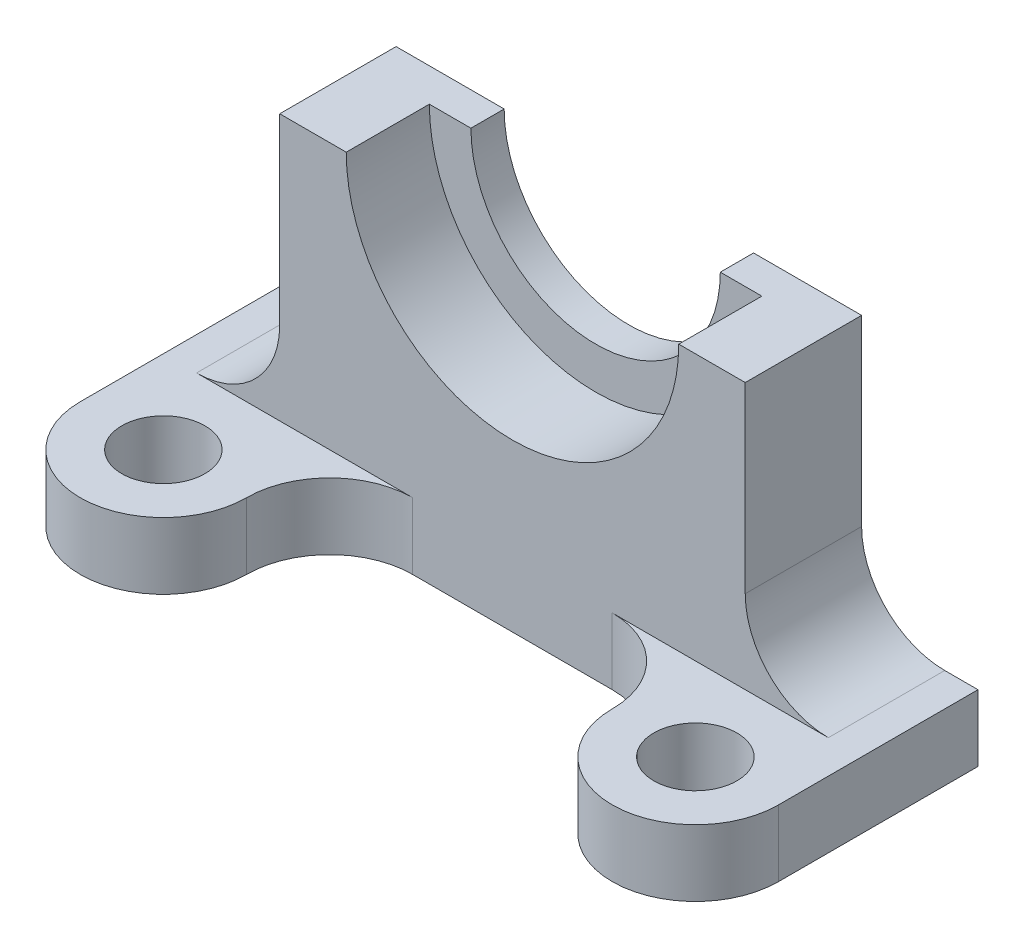
ISO-10303-21;
HEADER;
FILE_DESCRIPTION(('STEP AP214'),'2;1');
FILE_NAME('part.step','',(''),(''),'','','');
FILE_SCHEMA(('AUTOMOTIVE_DESIGN { 1 0 10303 214 1 1 1 1 }'));
ENDSEC;
DATA;
#1=APPLICATION_CONTEXT('core data for automotive mechanical design processes');
#2=APPLICATION_PROTOCOL_DEFINITION('international standard','automotive_design',2000,#1);
#3=PRODUCT_CONTEXT('',#1,'mechanical');
#4=PRODUCT('Part','Part','',(#3));
#5=PRODUCT_RELATED_PRODUCT_CATEGORY('part','',(#4));
#6=PRODUCT_DEFINITION_FORMATION('','',#4);
#7=PRODUCT_DEFINITION_CONTEXT('part definition',#1,'design');
#8=PRODUCT_DEFINITION('design','',#6,#7);
#9=PRODUCT_DEFINITION_SHAPE('','',#8);
#10=(LENGTH_UNIT() NAMED_UNIT(*) SI_UNIT(.MILLI.,.METRE.));
#11=(NAMED_UNIT(*) PLANE_ANGLE_UNIT() SI_UNIT($,.RADIAN.));
#12=(NAMED_UNIT(*) SI_UNIT($,.STERADIAN.) SOLID_ANGLE_UNIT());
#13=UNCERTAINTY_MEASURE_WITH_UNIT(LENGTH_MEASURE(1.E-05),#10,'distance_accuracy_value','');
#14=(GEOMETRIC_REPRESENTATION_CONTEXT(3) GLOBAL_UNCERTAINTY_ASSIGNED_CONTEXT((#13)) GLOBAL_UNIT_ASSIGNED_CONTEXT((#10,
#11,#12)) REPRESENTATION_CONTEXT('',''));
#15=CARTESIAN_POINT('',(0.,0.,0.));
#16=DIRECTION('',(0.,0.,1.));
#17=DIRECTION('',(1.,0.,0.));
#18=AXIS2_PLACEMENT_3D('',#15,#16,#17);
#19=CARTESIAN_POINT('',(0.,127.,44.45));
#20=DIRECTION('',(0.,0.,-1.));
#21=DIRECTION('',(-1.,0.,0.));
#22=AXIS2_PLACEMENT_3D('',#19,#20,#21);
#23=CYLINDRICAL_SURFACE('',#22,63.5);
#24=CARTESIAN_POINT('',(0.,127.,12.7));
#25=DIRECTION('',(0.,0.,-1.));
#26=DIRECTION('',(-1.,0.,0.));
#27=AXIS2_PLACEMENT_3D('',#24,#25,#26);
#28=CIRCLE('',#27,63.5);
#29=CARTESIAN_POINT('',(-63.5,127.,12.7));
#30=VERTEX_POINT('',#29);
#31=CARTESIAN_POINT('',(63.5,127.,12.7));
#32=VERTEX_POINT('',#31);
#33=EDGE_CURVE('E169',#30,#32,#28,.F.);
#34=ORIENTED_EDGE('',*,*,#33,.F.);
#35=DIRECTION('',(0.,0.,-1.));
#36=VECTOR('',#35,1.);
#37=CARTESIAN_POINT('',(-63.5,127.,44.45));
#38=LINE('',#37,#36);
#39=CARTESIAN_POINT('',(-63.5,127.,44.45));
#40=VERTEX_POINT('',#39);
#41=EDGE_CURVE('E235',#40,#30,#38,.T.);
#42=ORIENTED_EDGE('',*,*,#41,.F.);
#43=CARTESIAN_POINT('',(0.,127.,44.45));
#44=DIRECTION('',(0.,0.,-1.));
#45=DIRECTION('',(-1.,0.,0.));
#46=AXIS2_PLACEMENT_3D('',#43,#44,#45);
#47=CIRCLE('',#46,63.5);
#48=CARTESIAN_POINT('',(63.5,127.,44.45));
#49=VERTEX_POINT('',#48);
#50=EDGE_CURVE('E202',#49,#40,#47,.T.);
#51=ORIENTED_EDGE('',*,*,#50,.F.);
#52=DIRECTION('',(0.,0.,-1.));
#53=VECTOR('',#52,1.);
#54=CARTESIAN_POINT('',(63.5,127.,44.45));
#55=LINE('',#54,#53);
#56=EDGE_CURVE('E233',#49,#32,#55,.T.);
#57=ORIENTED_EDGE('',*,*,#56,.T.);
#58=EDGE_LOOP('',(#34,#42,#51,#57));
#59=FACE_BOUND('',#58,.T.);
#60=ADVANCED_FACE('F36',(#59),#23,.F.);
#61=CARTESIAN_POINT('',(38.1,25.4,76.2));
#62=DIRECTION('',(0.,1.,0.));
#63=DIRECTION('',(0.,0.,1.));
#64=AXIS2_PLACEMENT_3D('',#61,#62,#63);
#65=PLANE('',#64);
#66=DIRECTION('',(0.,0.,-1.));
#67=VECTOR('',#66,1.);
#68=CARTESIAN_POINT('',(120.65,25.4,44.45));
#69=LINE('',#68,#67);
#70=CARTESIAN_POINT('',(120.65,25.4,44.45));
#71=VERTEX_POINT('',#70);
#72=CARTESIAN_POINT('',(120.65,25.4,0.));
#73=VERTEX_POINT('',#72);
#74=EDGE_CURVE('E51',#71,#73,#69,.T.);
#75=ORIENTED_EDGE('',*,*,#74,.F.);
#76=DIRECTION('',(1.,0.,0.));
#77=VECTOR('',#76,1.);
#78=CARTESIAN_POINT('',(0.,25.4,44.45));
#79=LINE('',#78,#77);
#80=CARTESIAN_POINT('',(38.1,25.4,44.45));
#81=VERTEX_POINT('',#80);
#82=EDGE_CURVE('E195',#81,#71,#79,.T.);
#83=ORIENTED_EDGE('',*,*,#82,.F.);
#84=CARTESIAN_POINT('',(38.1,25.4,76.2));
#85=DIRECTION('',(0.,-1.,0.));
#86=DIRECTION('',(0.,0.,1.));
#87=AXIS2_PLACEMENT_3D('',#84,#85,#86);
#88=CIRCLE('',#87,31.75);
#89=CARTESIAN_POINT('',(69.85,25.4,76.2));
#90=VERTEX_POINT('',#89);
#91=EDGE_CURVE('E256',#81,#90,#88,.T.);
#92=ORIENTED_EDGE('',*,*,#91,.T.);
#93=CARTESIAN_POINT('',(101.6,25.4,76.2));
#94=DIRECTION('',(0.,1.,0.));
#95=DIRECTION('',(0.,0.,1.));
#96=AXIS2_PLACEMENT_3D('',#93,#94,#95);
#97=CIRCLE('',#96,31.75);
#98=CARTESIAN_POINT('',(133.35,25.4,76.2));
#99=VERTEX_POINT('',#98);
#100=EDGE_CURVE('E259',#90,#99,#97,.T.);
#101=ORIENTED_EDGE('',*,*,#100,.T.);
#102=DIRECTION('',(0.,0.,-1.));
#103=VECTOR('',#102,1.);
#104=CARTESIAN_POINT('',(133.35,25.4,76.2));
#105=LINE('',#104,#103);
#106=CARTESIAN_POINT('',(133.35,25.4,0.));
#107=VERTEX_POINT('',#106);
#108=EDGE_CURVE('E262',#99,#107,#105,.T.);
#109=ORIENTED_EDGE('',*,*,#108,.T.);
#110=DIRECTION('',(-1.,0.,0.));
#111=VECTOR('',#110,1.);
#112=CARTESIAN_POINT('',(-133.35,25.4,0.));
#113=LINE('',#112,#111);
#114=EDGE_CURVE('E265',#107,#73,#113,.T.);
#115=ORIENTED_EDGE('',*,*,#114,.T.);
#116=EDGE_LOOP('',(#75,#83,#92,#101,#109,#115));
#117=FACE_BOUND('',#116,.T.);
#118=CARTESIAN_POINT('',(101.6,25.4,76.2));
#119=DIRECTION('',(0.,1.,0.));
#120=DIRECTION('',(0.,0.,1.));
#121=AXIS2_PLACEMENT_3D('',#118,#119,#120);
#122=CIRCLE('',#121,15.875);
#123=CARTESIAN_POINT('',(101.6,25.4,92.075));
#124=VERTEX_POINT('',#123);
#125=EDGE_CURVE('E250',#124,#124,#122,.T.);
#126=ORIENTED_EDGE('',*,*,#125,.F.);
#127=EDGE_LOOP('',(#126));
#128=FACE_BOUND('',#127,.T.);
#129=ADVANCED_FACE('F374',(#117,#128),#65,.T.);
#130=DIRECTION('',(0.,0.,-1.));
#131=VECTOR('',#130,1.);
#132=CARTESIAN_POINT('',(-120.65,25.4,44.45));
#133=LINE('',#132,#131);
#134=CARTESIAN_POINT('',(-120.65,25.4,44.45));
#135=VERTEX_POINT('',#134);
#136=CARTESIAN_POINT('',(-120.65,25.4,0.));
#137=VERTEX_POINT('',#136);
#138=EDGE_CURVE('E212',#135,#137,#133,.T.);
#139=ORIENTED_EDGE('',*,*,#138,.T.);
#140=CARTESIAN_POINT('',(-133.35,25.4,0.));
#141=VERTEX_POINT('',#140);
#142=EDGE_CURVE('E264',#137,#141,#113,.T.);
#143=ORIENTED_EDGE('',*,*,#142,.T.);
#144=DIRECTION('',(0.,0.,1.));
#145=VECTOR('',#144,1.);
#146=CARTESIAN_POINT('',(-133.35,25.4,76.2));
#147=LINE('',#146,#145);
#148=CARTESIAN_POINT('',(-133.35,25.4,76.2));
#149=VERTEX_POINT('',#148);
#150=EDGE_CURVE('E267',#141,#149,#147,.T.);
#151=ORIENTED_EDGE('',*,*,#150,.T.);
#152=CARTESIAN_POINT('',(-101.6,25.4,76.2));
#153=DIRECTION('',(0.,1.,0.));
#154=DIRECTION('',(0.,0.,-1.));
#155=AXIS2_PLACEMENT_3D('',#152,#153,#154);
#156=CIRCLE('',#155,31.75);
#157=CARTESIAN_POINT('',(-69.85,25.4,76.2));
#158=VERTEX_POINT('',#157);
#159=EDGE_CURVE('E269',#149,#158,#156,.T.);
#160=ORIENTED_EDGE('',*,*,#159,.T.);
#161=CARTESIAN_POINT('',(-38.1,25.4,76.2));
#162=DIRECTION('',(0.,-1.,0.));
#163=DIRECTION('',(0.,0.,-1.));
#164=AXIS2_PLACEMENT_3D('',#161,#162,#163);
#165=CIRCLE('',#164,31.75);
#166=CARTESIAN_POINT('',(-38.1,25.4,44.45));
#167=VERTEX_POINT('',#166);
#168=EDGE_CURVE('E271',#158,#167,#165,.T.);
#169=ORIENTED_EDGE('',*,*,#168,.T.);
#170=EDGE_CURVE('E59',#135,#167,#79,.T.);
#171=ORIENTED_EDGE('',*,*,#170,.F.);
#172=EDGE_LOOP('',(#139,#143,#151,#160,#169,#171));
#173=FACE_BOUND('',#172,.T.);
#174=CARTESIAN_POINT('',(-101.6,25.4,76.2));
#175=DIRECTION('',(0.,1.,0.));
#176=DIRECTION('',(0.,0.,-1.));
#177=AXIS2_PLACEMENT_3D('',#174,#175,#176);
#178=CIRCLE('',#177,15.875);
#179=CARTESIAN_POINT('',(-101.6,25.4,60.325));
#180=VERTEX_POINT('',#179);
#181=EDGE_CURVE('E244',#180,#180,#178,.T.);
#182=ORIENTED_EDGE('',*,*,#181,.F.);
#183=EDGE_LOOP('',(#182));
#184=FACE_BOUND('',#183,.T.);
#185=ADVANCED_FACE('F330',(#173,#184),#65,.T.);
#186=CARTESIAN_POINT('',(38.1,0.,76.2));
#187=DIRECTION('',(0.,1.,0.));
#188=DIRECTION('',(0.,0.,1.));
#189=AXIS2_PLACEMENT_3D('',#186,#187,#188);
#190=PLANE('',#189);
#191=CARTESIAN_POINT('',(38.1,0.,76.2));
#192=DIRECTION('',(0.,-1.,0.));
#193=DIRECTION('',(0.,0.,1.));
#194=AXIS2_PLACEMENT_3D('',#191,#192,#193);
#195=CIRCLE('',#194,31.75);
#196=CARTESIAN_POINT('',(38.1,0.,44.45));
#197=VERTEX_POINT('',#196);
#198=CARTESIAN_POINT('',(69.85,0.,76.2));
#199=VERTEX_POINT('',#198);
#200=EDGE_CURVE('E253',#197,#199,#195,.T.);
#201=ORIENTED_EDGE('',*,*,#200,.F.);
#202=DIRECTION('',(1.,0.,0.));
#203=VECTOR('',#202,1.);
#204=CARTESIAN_POINT('',(-38.1,0.,44.45));
#205=LINE('',#204,#203);
#206=CARTESIAN_POINT('',(-38.1,0.,44.45));
#207=VERTEX_POINT('',#206);
#208=EDGE_CURVE('E260',#207,#197,#205,.T.);
#209=ORIENTED_EDGE('',*,*,#208,.F.);
#210=CARTESIAN_POINT('',(-38.1,0.,76.2));
#211=DIRECTION('',(0.,-1.,0.));
#212=DIRECTION('',(0.,0.,-1.));
#213=AXIS2_PLACEMENT_3D('',#210,#211,#212);
#214=CIRCLE('',#213,31.75);
#215=CARTESIAN_POINT('',(-69.85,0.,76.2));
#216=VERTEX_POINT('',#215);
#217=EDGE_CURVE('E286',#216,#207,#214,.T.);
#218=ORIENTED_EDGE('',*,*,#217,.F.);
#219=CARTESIAN_POINT('',(-101.6,0.,76.2));
#220=DIRECTION('',(0.,1.,0.));
#221=DIRECTION('',(0.,0.,-1.));
#222=AXIS2_PLACEMENT_3D('',#219,#220,#221);
#223=CIRCLE('',#222,31.75);
#224=CARTESIAN_POINT('',(-133.35,0.,76.2));
#225=VERTEX_POINT('',#224);
#226=EDGE_CURVE('E284',#225,#216,#223,.T.);
#227=ORIENTED_EDGE('',*,*,#226,.F.);
#228=DIRECTION('',(0.,0.,1.));
#229=VECTOR('',#228,1.);
#230=CARTESIAN_POINT('',(-133.35,0.,76.2));
#231=LINE('',#230,#229);
#232=CARTESIAN_POINT('',(-133.35,0.,0.));
#233=VERTEX_POINT('',#232);
#234=EDGE_CURVE('E282',#233,#225,#231,.T.);
#235=ORIENTED_EDGE('',*,*,#234,.F.);
#236=DIRECTION('',(-1.,0.,0.));
#237=VECTOR('',#236,1.);
#238=CARTESIAN_POINT('',(-133.35,0.,0.));
#239=LINE('',#238,#237);
#240=CARTESIAN_POINT('',(133.35,0.,0.));
#241=VERTEX_POINT('',#240);
#242=EDGE_CURVE('E280',#241,#233,#239,.T.);
#243=ORIENTED_EDGE('',*,*,#242,.F.);
#244=DIRECTION('',(0.,0.,-1.));
#245=VECTOR('',#244,1.);
#246=CARTESIAN_POINT('',(133.35,0.,76.2));
#247=LINE('',#246,#245);
#248=CARTESIAN_POINT('',(133.35,0.,76.2));
#249=VERTEX_POINT('',#248);
#250=EDGE_CURVE('E278',#249,#241,#247,.T.);
#251=ORIENTED_EDGE('',*,*,#250,.F.);
#252=CARTESIAN_POINT('',(101.6,0.,76.2));
#253=DIRECTION('',(0.,1.,0.));
#254=DIRECTION('',(0.,0.,1.));
#255=AXIS2_PLACEMENT_3D('',#252,#253,#254);
#256=CIRCLE('',#255,31.75);
#257=EDGE_CURVE('E276',#199,#249,#256,.T.);
#258=ORIENTED_EDGE('',*,*,#257,.F.);
#259=EDGE_LOOP('',(#201,#209,#218,#227,#235,#243,#251,#258));
#260=FACE_BOUND('',#259,.T.);
#261=CARTESIAN_POINT('',(101.6,0.,76.2));
#262=DIRECTION('',(0.,1.,0.));
#263=DIRECTION('',(0.,0.,1.));
#264=AXIS2_PLACEMENT_3D('',#261,#262,#263);
#265=CIRCLE('',#264,15.875);
#266=CARTESIAN_POINT('',(101.6,0.,92.075));
#267=VERTEX_POINT('',#266);
#268=EDGE_CURVE('E247',#267,#267,#265,.T.);
#269=ORIENTED_EDGE('',*,*,#268,.T.);
#270=EDGE_LOOP('',(#269));
#271=FACE_BOUND('',#270,.T.);
#272=CARTESIAN_POINT('',(-101.6,0.,76.2));
#273=DIRECTION('',(0.,1.,0.));
#274=DIRECTION('',(0.,0.,-1.));
#275=AXIS2_PLACEMENT_3D('',#272,#273,#274);
#276=CIRCLE('',#275,15.875);
#277=CARTESIAN_POINT('',(-101.6,0.,60.325));
#278=VERTEX_POINT('',#277);
#279=EDGE_CURVE('E228',#278,#278,#276,.T.);
#280=ORIENTED_EDGE('',*,*,#279,.T.);
#281=EDGE_LOOP('',(#280));
#282=FACE_BOUND('',#281,.T.);
#283=ADVANCED_FACE('F316',(#260,#271,#282),#190,.F.);
#284=CARTESIAN_POINT('',(38.1,25.4,76.2));
#285=DIRECTION('',(0.,-1.,0.));
#286=DIRECTION('',(0.,0.,-1.));
#287=AXIS2_PLACEMENT_3D('',#284,#285,#286);
#288=CYLINDRICAL_SURFACE('',#287,31.75);
#289=ORIENTED_EDGE('',*,*,#200,.T.);
#290=DIRECTION('',(0.,-1.,0.));
#291=VECTOR('',#290,1.);
#292=CARTESIAN_POINT('',(69.85,25.4,76.2));
#293=LINE('',#292,#291);
#294=EDGE_CURVE('E11',#90,#199,#293,.T.);
#295=ORIENTED_EDGE('',*,*,#294,.F.);
#296=ORIENTED_EDGE('',*,*,#91,.F.);
#297=DIRECTION('',(0.,-1.,0.));
#298=VECTOR('',#297,1.);
#299=CARTESIAN_POINT('',(38.1,25.4,44.45));
#300=LINE('',#299,#298);
#301=EDGE_CURVE('E273',#81,#197,#300,.T.);
#302=ORIENTED_EDGE('',*,*,#301,.T.);
#303=EDGE_LOOP('',(#289,#295,#296,#302));
#304=FACE_BOUND('',#303,.T.);
#305=ADVANCED_FACE('F38',(#304),#288,.F.);
#306=CARTESIAN_POINT('',(101.6,25.4,76.2));
#307=DIRECTION('',(0.,-1.,0.));
#308=DIRECTION('',(0.,0.,-1.));
#309=AXIS2_PLACEMENT_3D('',#306,#307,#308);
#310=CYLINDRICAL_SURFACE('',#309,31.75);
#311=ORIENTED_EDGE('',*,*,#257,.T.);
#312=DIRECTION('',(0.,-1.,0.));
#313=VECTOR('',#312,1.);
#314=CARTESIAN_POINT('',(133.35,25.4,76.2));
#315=LINE('',#314,#313);
#316=EDGE_CURVE('E44',#99,#249,#315,.T.);
#317=ORIENTED_EDGE('',*,*,#316,.F.);
#318=ORIENTED_EDGE('',*,*,#100,.F.);
#319=ORIENTED_EDGE('',*,*,#294,.T.);
#320=EDGE_LOOP('',(#311,#317,#318,#319));
#321=FACE_BOUND('',#320,.T.);
#322=ADVANCED_FACE('F409',(#321),#310,.T.);
#323=CARTESIAN_POINT('',(133.35,25.4,76.2));
#324=DIRECTION('',(-1.,0.,0.));
#325=DIRECTION('',(0.,0.,1.));
#326=AXIS2_PLACEMENT_3D('',#323,#324,#325);
#327=PLANE('',#326);
#328=ORIENTED_EDGE('',*,*,#250,.T.);
#329=DIRECTION('',(0.,-1.,0.));
#330=VECTOR('',#329,1.);
#331=CARTESIAN_POINT('',(133.35,25.4,0.));
#332=LINE('',#331,#330);
#333=EDGE_CURVE('E303',#107,#241,#332,.T.);
#334=ORIENTED_EDGE('',*,*,#333,.F.);
#335=ORIENTED_EDGE('',*,*,#108,.F.);
#336=ORIENTED_EDGE('',*,*,#316,.T.);
#337=EDGE_LOOP('',(#328,#334,#335,#336));
#338=FACE_BOUND('',#337,.T.);
#339=ADVANCED_FACE('F310',(#338),#327,.F.);
#340=CARTESIAN_POINT('',(-133.35,25.4,0.));
#341=DIRECTION('',(0.,0.,1.));
#342=DIRECTION('',(1.,0.,0.));
#343=AXIS2_PLACEMENT_3D('',#340,#341,#342);
#344=PLANE('',#343);
#345=ORIENTED_EDGE('',*,*,#242,.T.);
#346=DIRECTION('',(0.,-1.,0.));
#347=VECTOR('',#346,1.);
#348=CARTESIAN_POINT('',(-133.35,25.4,0.));
#349=LINE('',#348,#347);
#350=EDGE_CURVE('E300',#141,#233,#349,.T.);
#351=ORIENTED_EDGE('',*,*,#350,.F.);
#352=ORIENTED_EDGE('',*,*,#142,.F.);
#353=CARTESIAN_POINT('',(-120.65,57.15,0.));
#354=DIRECTION('',(0.,0.,-1.));
#355=DIRECTION('',(-1.,0.,0.));
#356=AXIS2_PLACEMENT_3D('',#353,#354,#355);
#357=CIRCLE('',#356,31.75);
#358=CARTESIAN_POINT('',(-88.9,57.1500000000002,0.));
#359=VERTEX_POINT('',#358);
#360=EDGE_CURVE('E191',#137,#359,#357,.F.);
#361=ORIENTED_EDGE('',*,*,#360,.T.);
#362=DIRECTION('',(0.,-1.,0.));
#363=VECTOR('',#362,1.);
#364=CARTESIAN_POINT('',(-88.9,0.,0.));
#365=LINE('',#364,#363);
#366=CARTESIAN_POINT('',(-88.9,127.,0.));
#367=VERTEX_POINT('',#366);
#368=EDGE_CURVE('E215',#367,#359,#365,.T.);
#369=ORIENTED_EDGE('',*,*,#368,.F.);
#370=DIRECTION('',(-1.,0.,0.));
#371=VECTOR('',#370,1.);
#372=CARTESIAN_POINT('',(0.,127.,0.));
#373=LINE('',#372,#371);
#374=CARTESIAN_POINT('',(-47.625,127.,0.));
#375=VERTEX_POINT('',#374);
#376=EDGE_CURVE('E218',#375,#367,#373,.T.);
#377=ORIENTED_EDGE('',*,*,#376,.F.);
#378=CARTESIAN_POINT('',(0.,127.,0.));
#379=DIRECTION('',(0.,0.,-1.));
#380=DIRECTION('',(-1.,0.,0.));
#381=AXIS2_PLACEMENT_3D('',#378,#379,#380);
#382=CIRCLE('',#381,47.625);
#383=CARTESIAN_POINT('',(47.625,127.,0.));
#384=VERTEX_POINT('',#383);
#385=EDGE_CURVE('E186',#384,#375,#382,.T.);
#386=ORIENTED_EDGE('',*,*,#385,.F.);
#387=DIRECTION('',(1.,0.,0.));
#388=VECTOR('',#387,1.);
#389=CARTESIAN_POINT('',(0.,127.,0.));
#390=LINE('',#389,#388);
#391=CARTESIAN_POINT('',(88.9,127.,0.));
#392=VERTEX_POINT('',#391);
#393=EDGE_CURVE('E178',#384,#392,#390,.T.);
#394=ORIENTED_EDGE('',*,*,#393,.T.);
#395=DIRECTION('',(0.,-1.,0.));
#396=VECTOR('',#395,1.);
#397=CARTESIAN_POINT('',(88.9,0.,0.));
#398=LINE('',#397,#396);
#399=CARTESIAN_POINT('',(88.9,57.1500000000002,0.));
#400=VERTEX_POINT('',#399);
#401=EDGE_CURVE('E221',#392,#400,#398,.T.);
#402=ORIENTED_EDGE('',*,*,#401,.T.);
#403=CARTESIAN_POINT('',(120.65,57.15,0.));
#404=DIRECTION('',(0.,0.,-1.));
#405=DIRECTION('',(-1.,0.,0.));
#406=AXIS2_PLACEMENT_3D('',#403,#404,#405);
#407=CIRCLE('',#406,31.75);
#408=EDGE_CURVE('E224',#73,#400,#407,.T.);
#409=ORIENTED_EDGE('',*,*,#408,.F.);
#410=ORIENTED_EDGE('',*,*,#114,.F.);
#411=ORIENTED_EDGE('',*,*,#333,.T.);
#412=EDGE_LOOP('',(#345,#351,#352,#361,#369,#377,#386,#394,#402,#409,#410,#411));
#413=FACE_BOUND('',#412,.T.);
#414=ADVANCED_FACE('F322',(#413),#344,.F.);
#415=CARTESIAN_POINT('',(-133.35,25.4,76.2));
#416=DIRECTION('',(1.,0.,0.));
#417=DIRECTION('',(0.,0.,-1.));
#418=AXIS2_PLACEMENT_3D('',#415,#416,#417);
#419=PLANE('',#418);
#420=ORIENTED_EDGE('',*,*,#234,.T.);
#421=DIRECTION('',(0.,-1.,0.));
#422=VECTOR('',#421,1.);
#423=CARTESIAN_POINT('',(-133.35,25.4,76.2));
#424=LINE('',#423,#422);
#425=EDGE_CURVE('E297',#149,#225,#424,.T.);
#426=ORIENTED_EDGE('',*,*,#425,.F.);
#427=ORIENTED_EDGE('',*,*,#150,.F.);
#428=ORIENTED_EDGE('',*,*,#350,.T.);
#429=EDGE_LOOP('',(#420,#426,#427,#428));
#430=FACE_BOUND('',#429,.T.);
#431=ADVANCED_FACE('F327',(#430),#419,.F.);
#432=CARTESIAN_POINT('',(-101.6,25.4,76.2));
#433=DIRECTION('',(0.,-1.,0.));
#434=DIRECTION('',(0.,0.,-1.));
#435=AXIS2_PLACEMENT_3D('',#432,#433,#434);
#436=CYLINDRICAL_SURFACE('',#435,31.75);
#437=ORIENTED_EDGE('',*,*,#226,.T.);
#438=DIRECTION('',(0.,-1.,0.));
#439=VECTOR('',#438,1.);
#440=CARTESIAN_POINT('',(-69.85,25.4,76.2));
#441=LINE('',#440,#439);
#442=EDGE_CURVE('E294',#158,#216,#441,.T.);
#443=ORIENTED_EDGE('',*,*,#442,.F.);
#444=ORIENTED_EDGE('',*,*,#159,.F.);
#445=ORIENTED_EDGE('',*,*,#425,.T.);
#446=EDGE_LOOP('',(#437,#443,#444,#445));
#447=FACE_BOUND('',#446,.T.);
#448=ADVANCED_FACE('F399',(#447),#436,.T.);
#449=CARTESIAN_POINT('',(-38.1,25.4,76.2));
#450=DIRECTION('',(0.,-1.,0.));
#451=DIRECTION('',(0.,0.,-1.));
#452=AXIS2_PLACEMENT_3D('',#449,#450,#451);
#453=CYLINDRICAL_SURFACE('',#452,31.75);
#454=ORIENTED_EDGE('',*,*,#217,.T.);
#455=DIRECTION('',(0.,-1.,0.));
#456=VECTOR('',#455,1.);
#457=CARTESIAN_POINT('',(-38.1,25.4,44.45));
#458=LINE('',#457,#456);
#459=EDGE_CURVE('E291',#167,#207,#458,.T.);
#460=ORIENTED_EDGE('',*,*,#459,.F.);
#461=ORIENTED_EDGE('',*,*,#168,.F.);
#462=ORIENTED_EDGE('',*,*,#442,.T.);
#463=EDGE_LOOP('',(#454,#460,#461,#462));
#464=FACE_BOUND('',#463,.T.);
#465=ADVANCED_FACE('F396',(#464),#453,.F.);
#466=CARTESIAN_POINT('',(-38.1,25.4,44.45));
#467=DIRECTION('',(0.,0.,-1.));
#468=DIRECTION('',(-1.,0.,0.));
#469=AXIS2_PLACEMENT_3D('',#466,#467,#468);
#470=PLANE('',#469);
#471=ORIENTED_EDGE('',*,*,#208,.T.);
#472=ORIENTED_EDGE('',*,*,#301,.F.);
#473=ORIENTED_EDGE('',*,*,#82,.T.);
#474=CARTESIAN_POINT('',(120.65,57.15,44.45));
#475=DIRECTION('',(0.,0.,-1.));
#476=DIRECTION('',(-1.,0.,0.));
#477=AXIS2_PLACEMENT_3D('',#474,#475,#476);
#478=CIRCLE('',#477,31.75);
#479=CARTESIAN_POINT('',(88.9,57.1500000000002,44.45));
#480=VERTEX_POINT('',#479);
#481=EDGE_CURVE('E210',#71,#480,#478,.T.);
#482=ORIENTED_EDGE('',*,*,#481,.T.);
#483=DIRECTION('',(0.,-1.,0.));
#484=VECTOR('',#483,1.);
#485=CARTESIAN_POINT('',(88.9,0.,44.45));
#486=LINE('',#485,#484);
#487=CARTESIAN_POINT('',(88.9,127.,44.45));
#488=VERTEX_POINT('',#487);
#489=EDGE_CURVE('E207',#488,#480,#486,.T.);
#490=ORIENTED_EDGE('',*,*,#489,.F.);
#491=DIRECTION('',(1.,0.,0.));
#492=VECTOR('',#491,1.);
#493=CARTESIAN_POINT('',(0.,127.,44.45));
#494=LINE('',#493,#492);
#495=EDGE_CURVE('E204',#49,#488,#494,.T.);
#496=ORIENTED_EDGE('',*,*,#495,.F.);
#497=ORIENTED_EDGE('',*,*,#50,.T.);
#498=DIRECTION('',(-1.,0.,0.));
#499=VECTOR('',#498,1.);
#500=CARTESIAN_POINT('',(0.,127.,44.45));
#501=LINE('',#500,#499);
#502=CARTESIAN_POINT('',(-88.9,127.,44.45));
#503=VERTEX_POINT('',#502);
#504=EDGE_CURVE('E200',#40,#503,#501,.T.);
#505=ORIENTED_EDGE('',*,*,#504,.T.);
#506=DIRECTION('',(0.,-1.,0.));
#507=VECTOR('',#506,1.);
#508=CARTESIAN_POINT('',(-88.9,0.,44.45));
#509=LINE('',#508,#507);
#510=CARTESIAN_POINT('',(-88.9,57.1500000000002,44.45));
#511=VERTEX_POINT('',#510);
#512=EDGE_CURVE('E198',#503,#511,#509,.T.);
#513=ORIENTED_EDGE('',*,*,#512,.T.);
#514=CARTESIAN_POINT('',(-120.65,57.15,44.45));
#515=DIRECTION('',(0.,0.,-1.));
#516=DIRECTION('',(-1.,0.,0.));
#517=AXIS2_PLACEMENT_3D('',#514,#515,#516);
#518=CIRCLE('',#517,31.75);
#519=EDGE_CURVE('E194',#135,#511,#518,.F.);
#520=ORIENTED_EDGE('',*,*,#519,.F.);
#521=ORIENTED_EDGE('',*,*,#170,.T.);
#522=ORIENTED_EDGE('',*,*,#459,.T.);
#523=EDGE_LOOP('',(#471,#472,#473,#482,#490,#496,#497,#505,#513,#520,#521,#522));
#524=FACE_BOUND('',#523,.T.);
#525=ADVANCED_FACE('F353',(#524),#470,.F.);
#526=CARTESIAN_POINT('',(101.6,25.4,76.2));
#527=DIRECTION('',(0.,-1.,0.));
#528=DIRECTION('',(0.,0.,-1.));
#529=AXIS2_PLACEMENT_3D('',#526,#527,#528);
#530=CYLINDRICAL_SURFACE('',#529,15.875);
#531=ORIENTED_EDGE('',*,*,#125,.T.);
#532=EDGE_LOOP('',(#531));
#533=FACE_BOUND('',#532,.T.);
#534=ORIENTED_EDGE('',*,*,#268,.F.);
#535=EDGE_LOOP('',(#534));
#536=FACE_BOUND('',#535,.T.);
#537=ADVANCED_FACE('F369',(#533,#536),#530,.F.);
#538=CARTESIAN_POINT('',(-101.6,25.4,76.2));
#539=DIRECTION('',(0.,-1.,0.));
#540=DIRECTION('',(0.,0.,-1.));
#541=AXIS2_PLACEMENT_3D('',#538,#539,#540);
#542=CYLINDRICAL_SURFACE('',#541,15.875);
#543=ORIENTED_EDGE('',*,*,#181,.T.);
#544=EDGE_LOOP('',(#543));
#545=FACE_BOUND('',#544,.T.);
#546=ORIENTED_EDGE('',*,*,#279,.F.);
#547=EDGE_LOOP('',(#546));
#548=FACE_BOUND('',#547,.T.);
#549=ADVANCED_FACE('F362',(#545,#548),#542,.F.);
#550=CARTESIAN_POINT('',(120.65,57.15,44.45));
#551=DIRECTION('',(0.,0.,-1.));
#552=DIRECTION('',(-1.,0.,0.));
#553=AXIS2_PLACEMENT_3D('',#550,#551,#552);
#554=CYLINDRICAL_SURFACE('',#553,31.75);
#555=ORIENTED_EDGE('',*,*,#408,.T.);
#556=DIRECTION('',(0.,0.,-1.));
#557=VECTOR('',#556,1.);
#558=CARTESIAN_POINT('',(88.9,57.1500000000002,44.45));
#559=LINE('',#558,#557);
#560=EDGE_CURVE('E229',#480,#400,#559,.T.);
#561=ORIENTED_EDGE('',*,*,#560,.F.);
#562=ORIENTED_EDGE('',*,*,#481,.F.);
#563=ORIENTED_EDGE('',*,*,#74,.T.);
#564=EDGE_LOOP('',(#555,#561,#562,#563));
#565=FACE_BOUND('',#564,.T.);
#566=ADVANCED_FACE('F360',(#565),#554,.F.);
#567=CARTESIAN_POINT('',(88.9,0.,44.45));
#568=DIRECTION('',(1.,0.,0.));
#569=DIRECTION('',(0.,1.,0.));
#570=AXIS2_PLACEMENT_3D('',#567,#568,#569);
#571=PLANE('',#570);
#572=ORIENTED_EDGE('',*,*,#401,.F.);
#573=DIRECTION('',(0.,0.,-1.));
#574=VECTOR('',#573,1.);
#575=CARTESIAN_POINT('',(88.9,127.,44.45));
#576=LINE('',#575,#574);
#577=EDGE_CURVE('E231',#488,#392,#576,.T.);
#578=ORIENTED_EDGE('',*,*,#577,.F.);
#579=ORIENTED_EDGE('',*,*,#489,.T.);
#580=ORIENTED_EDGE('',*,*,#560,.T.);
#581=EDGE_LOOP('',(#572,#578,#579,#580));
#582=FACE_BOUND('',#581,.T.);
#583=ADVANCED_FACE('F357',(#582),#571,.T.);
#584=CARTESIAN_POINT('',(0.,127.,44.45));
#585=DIRECTION('',(0.,1.,0.));
#586=DIRECTION('',(0.,0.,1.));
#587=AXIS2_PLACEMENT_3D('',#584,#585,#586);
#588=PLANE('',#587);
#589=ORIENTED_EDGE('',*,*,#393,.F.);
#590=DIRECTION('',(0.,0.,-1.));
#591=VECTOR('',#590,1.);
#592=CARTESIAN_POINT('',(47.625,127.,12.7));
#593=LINE('',#592,#591);
#594=CARTESIAN_POINT('',(47.625,127.,12.7));
#595=VERTEX_POINT('',#594);
#596=EDGE_CURVE('E175',#595,#384,#593,.T.);
#597=ORIENTED_EDGE('',*,*,#596,.F.);
#598=DIRECTION('',(-1.,0.,0.));
#599=VECTOR('',#598,1.);
#600=CARTESIAN_POINT('',(0.,127.,12.7));
#601=LINE('',#600,#599);
#602=EDGE_CURVE('E162',#32,#595,#601,.T.);
#603=ORIENTED_EDGE('',*,*,#602,.F.);
#604=ORIENTED_EDGE('',*,*,#56,.F.);
#605=ORIENTED_EDGE('',*,*,#495,.T.);
#606=ORIENTED_EDGE('',*,*,#577,.T.);
#607=EDGE_LOOP('',(#589,#597,#603,#604,#605,#606));
#608=FACE_BOUND('',#607,.T.);
#609=ADVANCED_FACE('F176',(#608),#588,.T.);
#610=CARTESIAN_POINT('',(0.,127.,44.45));
#611=DIRECTION('',(0.,-1.,0.));
#612=DIRECTION('',(0.,0.,-1.));
#613=AXIS2_PLACEMENT_3D('',#610,#611,#612);
#614=PLANE('',#613);
#615=ORIENTED_EDGE('',*,*,#376,.T.);
#616=DIRECTION('',(0.,0.,-1.));
#617=VECTOR('',#616,1.);
#618=CARTESIAN_POINT('',(-88.9,127.,44.45));
#619=LINE('',#618,#617);
#620=EDGE_CURVE('E238',#503,#367,#619,.T.);
#621=ORIENTED_EDGE('',*,*,#620,.F.);
#622=ORIENTED_EDGE('',*,*,#504,.F.);
#623=ORIENTED_EDGE('',*,*,#41,.T.);
#624=CARTESIAN_POINT('',(-47.625,127.,12.7));
#625=VERTEX_POINT('',#624);
#626=EDGE_CURVE('E173',#625,#30,#601,.T.);
#627=ORIENTED_EDGE('',*,*,#626,.F.);
#628=DIRECTION('',(0.,0.,-1.));
#629=VECTOR('',#628,1.);
#630=CARTESIAN_POINT('',(-47.625,127.,12.7));
#631=LINE('',#630,#629);
#632=EDGE_CURVE('E182',#625,#375,#631,.T.);
#633=ORIENTED_EDGE('',*,*,#632,.T.);
#634=EDGE_LOOP('',(#615,#621,#622,#623,#627,#633));
#635=FACE_BOUND('',#634,.T.);
#636=ADVANCED_FACE('F344',(#635),#614,.F.);
#637=CARTESIAN_POINT('',(-88.9,0.,44.45));
#638=DIRECTION('',(1.,0.,0.));
#639=DIRECTION('',(0.,1.,0.));
#640=AXIS2_PLACEMENT_3D('',#637,#638,#639);
#641=PLANE('',#640);
#642=ORIENTED_EDGE('',*,*,#368,.T.);
#643=DIRECTION('',(0.,0.,-1.));
#644=VECTOR('',#643,1.);
#645=CARTESIAN_POINT('',(-88.9,57.1500000000002,44.45));
#646=LINE('',#645,#644);
#647=EDGE_CURVE('E241',#511,#359,#646,.T.);
#648=ORIENTED_EDGE('',*,*,#647,.F.);
#649=ORIENTED_EDGE('',*,*,#512,.F.);
#650=ORIENTED_EDGE('',*,*,#620,.T.);
#651=EDGE_LOOP('',(#642,#648,#649,#650));
#652=FACE_BOUND('',#651,.T.);
#653=ADVANCED_FACE('F341',(#652),#641,.F.);
#654=CARTESIAN_POINT('',(-120.65,57.15,44.45));
#655=DIRECTION('',(0.,0.,-1.));
#656=DIRECTION('',(-1.,0.,0.));
#657=AXIS2_PLACEMENT_3D('',#654,#655,#656);
#658=CYLINDRICAL_SURFACE('',#657,31.75);
#659=ORIENTED_EDGE('',*,*,#360,.F.);
#660=ORIENTED_EDGE('',*,*,#138,.F.);
#661=ORIENTED_EDGE('',*,*,#519,.T.);
#662=ORIENTED_EDGE('',*,*,#647,.T.);
#663=EDGE_LOOP('',(#659,#660,#661,#662));
#664=FACE_BOUND('',#663,.T.);
#665=ADVANCED_FACE('F336',(#664),#658,.F.);
#666=CARTESIAN_POINT('',(0.,127.,12.7));
#667=DIRECTION('',(0.,0.,-1.));
#668=DIRECTION('',(-1.,0.,0.));
#669=AXIS2_PLACEMENT_3D('',#666,#667,#668);
#670=CYLINDRICAL_SURFACE('',#669,47.625);
#671=ORIENTED_EDGE('',*,*,#385,.T.);
#672=ORIENTED_EDGE('',*,*,#632,.F.);
#673=CARTESIAN_POINT('',(0.,127.,12.7));
#674=DIRECTION('',(0.,0.,-1.));
#675=DIRECTION('',(-1.,0.,0.));
#676=AXIS2_PLACEMENT_3D('',#673,#674,#675);
#677=CIRCLE('',#676,47.625);
#678=EDGE_CURVE('E166',#595,#625,#677,.T.);
#679=ORIENTED_EDGE('',*,*,#678,.F.);
#680=ORIENTED_EDGE('',*,*,#596,.T.);
#681=EDGE_LOOP('',(#671,#672,#679,#680));
#682=FACE_BOUND('',#681,.T.);
#683=ADVANCED_FACE('F184',(#682),#670,.F.);
#684=CARTESIAN_POINT('',(0.,0.,12.7));
#685=DIRECTION('',(0.,0.,-1.));
#686=DIRECTION('',(-1.,0.,0.));
#687=AXIS2_PLACEMENT_3D('',#684,#685,#686);
#688=PLANE('',#687);
#689=ORIENTED_EDGE('',*,*,#678,.T.);
#690=ORIENTED_EDGE('',*,*,#626,.T.);
#691=ORIENTED_EDGE('',*,*,#33,.T.);
#692=ORIENTED_EDGE('',*,*,#602,.T.);
#693=EDGE_LOOP('',(#689,#690,#691,#692));
#694=FACE_BOUND('',#693,.T.);
#695=ADVANCED_FACE('F164',(#694),#688,.F.);
#696=CLOSED_SHELL('',(#60,#129,#185,#283,#305,#322,#339,#414,#431,#448,#465,#525,#537,#549,#566,
#583,#609,#636,#653,#665,#683,#695));
#697=MANIFOLD_SOLID_BREP('B2',#696);
#698=ADVANCED_BREP_SHAPE_REPRESENTATION('',(#18,#697),#14);
#699=SHAPE_DEFINITION_REPRESENTATION(#9,#698);
ENDSEC;
END-ISO-10303-21;
